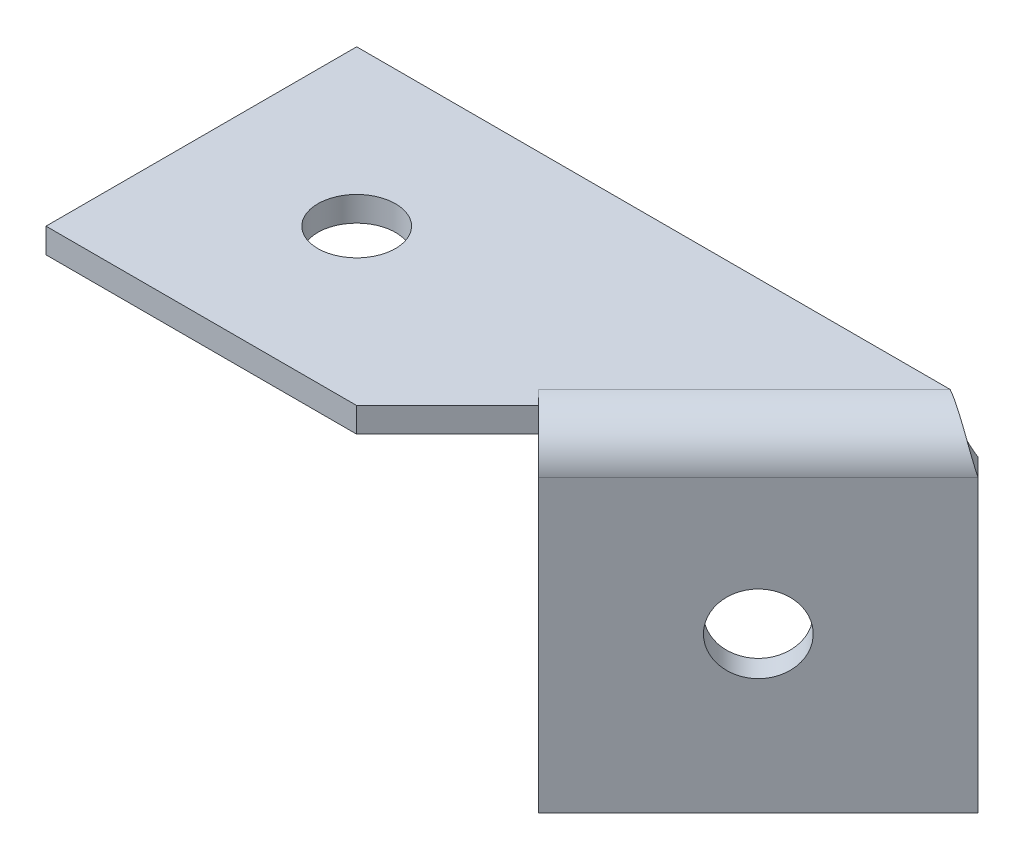
ISO-10303-21;
HEADER;
FILE_DESCRIPTION(('STEP AP214'),'2;1');
FILE_NAME('part.step','',(''),(''),'','','');
FILE_SCHEMA(('AUTOMOTIVE_DESIGN { 1 0 10303 214 1 1 1 1 }'));
ENDSEC;
DATA;
#1=APPLICATION_CONTEXT('core data for automotive mechanical design processes');
#2=APPLICATION_PROTOCOL_DEFINITION('international standard','automotive_design',2000,#1);
#3=PRODUCT_CONTEXT('',#1,'mechanical');
#4=PRODUCT('Part','Part','',(#3));
#5=PRODUCT_RELATED_PRODUCT_CATEGORY('part','',(#4));
#6=PRODUCT_DEFINITION_FORMATION('','',#4);
#7=PRODUCT_DEFINITION_CONTEXT('part definition',#1,'design');
#8=PRODUCT_DEFINITION('design','',#6,#7);
#9=PRODUCT_DEFINITION_SHAPE('','',#8);
#10=(LENGTH_UNIT() NAMED_UNIT(*) SI_UNIT(.MILLI.,.METRE.));
#11=(NAMED_UNIT(*) PLANE_ANGLE_UNIT() SI_UNIT($,.RADIAN.));
#12=(NAMED_UNIT(*) SI_UNIT($,.STERADIAN.) SOLID_ANGLE_UNIT());
#13=UNCERTAINTY_MEASURE_WITH_UNIT(LENGTH_MEASURE(1.E-05),#10,'distance_accuracy_value','');
#14=(GEOMETRIC_REPRESENTATION_CONTEXT(3) GLOBAL_UNCERTAINTY_ASSIGNED_CONTEXT((#13)) GLOBAL_UNIT_ASSIGNED_CONTEXT((#10,
#11,#12)) REPRESENTATION_CONTEXT('',''));
#15=CARTESIAN_POINT('',(0.,0.,0.));
#16=DIRECTION('',(0.,0.,1.));
#17=DIRECTION('',(1.,0.,0.));
#18=AXIS2_PLACEMENT_3D('',#15,#16,#17);
#19=CARTESIAN_POINT('',(9.95983876416214,-3.2,3.24411001162404));
#20=DIRECTION('',(0.707106781186547,0.,-0.707106781186547));
#21=DIRECTION('',(-0.707106781186548,0.,-0.707106781186548));
#22=AXIS2_PLACEMENT_3D('',#19,#20,#21);
#23=PLANE('',#22);
#24=DIRECTION('',(-0.707106781186548,0.,-0.707106781186548));
#25=VECTOR('',#24,1.);
#26=CARTESIAN_POINT('',(3.35786437626905,-1.6,-3.35786437626905));
#27=LINE('',#26,#25);
#28=CARTESIAN_POINT('',(10.8578643762691,-1.6,4.14213562373095));
#29=VERTEX_POINT('',#28);
#30=CARTESIAN_POINT('',(9.95983876416214,-1.6,3.24411001162404));
#31=VERTEX_POINT('',#30);
#32=EDGE_CURVE('E282',#29,#31,#27,.T.);
#33=ORIENTED_EDGE('',*,*,#32,.F.);
#34=DIRECTION('',(0.,1.,0.));
#35=VECTOR('',#34,1.);
#36=CARTESIAN_POINT('',(10.8578643762691,-3.2,4.14213562373095));
#37=LINE('',#36,#35);
#38=CARTESIAN_POINT('',(10.8578643762691,-1.89628672925673,4.14213562373095));
#39=VERTEX_POINT('',#38);
#40=EDGE_CURVE('E291',#39,#29,#37,.T.);
#41=ORIENTED_EDGE('',*,*,#40,.F.);
#42=CARTESIAN_POINT('',(9.95983876416214,-4.47,3.24411001162404));
#43=DIRECTION('',(-0.707106781186548,0.,0.707106781186548));
#44=DIRECTION('',(-0.707106781186548,0.,-0.707106781186548));
#45=AXIS2_PLACEMENT_3D('',#42,#43,#44);
#46=CIRCLE('',#45,2.87);
#47=EDGE_CURVE('E295',#31,#39,#46,.F.);
#48=ORIENTED_EDGE('',*,*,#47,.F.);
#49=EDGE_LOOP('',(#33,#41,#48));
#50=FACE_BOUND('',#49,.T.);
#51=ADVANCED_FACE('F43',(#50),#23,.T.);
#52=CARTESIAN_POINT('',(-15.,-1.6,-10.));
#53=DIRECTION('',(0.,0.,-1.));
#54=DIRECTION('',(-1.,0.,0.));
#55=AXIS2_PLACEMENT_3D('',#52,#53,#54);
#56=PLANE('',#55);
#57=DIRECTION('',(-1.,0.,0.));
#58=VECTOR('',#57,1.);
#59=CARTESIAN_POINT('',(-15.,-3.2,-10.));
#60=LINE('',#59,#58);
#61=CARTESIAN_POINT('',(23.2039487757862,-3.2,-10.));
#62=VERTEX_POINT('',#61);
#63=CARTESIAN_POINT('',(-15.,-3.2,-10.));
#64=VERTEX_POINT('',#63);
#65=EDGE_CURVE('E252',#62,#64,#60,.T.);
#66=ORIENTED_EDGE('',*,*,#65,.T.);
#67=DIRECTION('',(0.,-1.,0.));
#68=VECTOR('',#67,1.);
#69=CARTESIAN_POINT('',(-15.,-1.6,-10.));
#70=LINE('',#69,#68);
#71=CARTESIAN_POINT('',(-15.,-1.6,-10.));
#72=VERTEX_POINT('',#71);
#73=EDGE_CURVE('E11',#72,#64,#70,.T.);
#74=ORIENTED_EDGE('',*,*,#73,.F.);
#75=DIRECTION('',(-1.,0.,0.));
#76=VECTOR('',#75,1.);
#77=CARTESIAN_POINT('',(-15.,-1.6,-10.));
#78=LINE('',#77,#76);
#79=CARTESIAN_POINT('',(23.2039487757862,-1.6,-10.));
#80=VERTEX_POINT('',#79);
#81=EDGE_CURVE('E258',#80,#72,#78,.T.);
#82=ORIENTED_EDGE('',*,*,#81,.F.);
#83=DIRECTION('',(0.,1.,0.));
#84=VECTOR('',#83,1.);
#85=CARTESIAN_POINT('',(23.2039487757862,-3.2,-10.));
#86=LINE('',#85,#84);
#87=EDGE_CURVE('E165',#62,#80,#86,.T.);
#88=ORIENTED_EDGE('',*,*,#87,.F.);
#89=EDGE_LOOP('',(#66,#74,#82,#88));
#90=FACE_BOUND('',#89,.T.);
#91=ADVANCED_FACE('F208',(#90),#56,.T.);
#92=CARTESIAN_POINT('',(5.,-1.6,10.));
#93=DIRECTION('',(0.707106781186548,0.,0.707106781186548));
#94=DIRECTION('',(0.707106781186548,0.,-0.707106781186548));
#95=AXIS2_PLACEMENT_3D('',#92,#93,#94);
#96=PLANE('',#95);
#97=DIRECTION('',(0.707106781186548,0.,-0.707106781186547));
#98=VECTOR('',#97,1.);
#99=CARTESIAN_POINT('',(5.,-1.6,10.));
#100=LINE('',#99,#98);
#101=CARTESIAN_POINT('',(5.,-1.6,10.));
#102=VERTEX_POINT('',#101);
#103=EDGE_CURVE('E255',#102,#29,#100,.T.);
#104=ORIENTED_EDGE('',*,*,#103,.F.);
#105=DIRECTION('',(0.,-1.,0.));
#106=VECTOR('',#105,1.);
#107=CARTESIAN_POINT('',(5.,-1.6,10.));
#108=LINE('',#107,#106);
#109=CARTESIAN_POINT('',(5.,-3.2,10.));
#110=VERTEX_POINT('',#109);
#111=EDGE_CURVE('E53',#102,#110,#108,.T.);
#112=ORIENTED_EDGE('',*,*,#111,.T.);
#113=DIRECTION('',(0.707106781186548,0.,-0.707106781186547));
#114=VECTOR('',#113,1.);
#115=CARTESIAN_POINT('',(5.,-3.2,10.));
#116=LINE('',#115,#114);
#117=CARTESIAN_POINT('',(10.8578643762691,-3.2,4.14213562373095));
#118=VERTEX_POINT('',#117);
#119=EDGE_CURVE('E245',#110,#118,#116,.T.);
#120=ORIENTED_EDGE('',*,*,#119,.T.);
#121=EDGE_CURVE('E289',#118,#39,#37,.T.);
#122=ORIENTED_EDGE('',*,*,#121,.T.);
#123=ORIENTED_EDGE('',*,*,#40,.T.);
#124=EDGE_LOOP('',(#104,#112,#120,#122,#123));
#125=FACE_BOUND('',#124,.T.);
#126=ADVANCED_FACE('F219',(#125),#96,.T.);
#127=CARTESIAN_POINT('',(0.,-1.6,0.));
#128=DIRECTION('',(0.,-1.,0.));
#129=DIRECTION('',(0.,0.,1.));
#130=AXIS2_PLACEMENT_3D('',#127,#128,#129);
#131=PLANE('',#130);
#132=CARTESIAN_POINT('',(-5.,-1.6,0.));
#133=DIRECTION('',(0.,1.,0.));
#134=DIRECTION('',(0.,0.,1.));
#135=AXIS2_PLACEMENT_3D('',#132,#133,#134);
#136=CIRCLE('',#135,2.5);
#137=CARTESIAN_POINT('',(-5.,-1.6,2.5));
#138=VERTEX_POINT('',#137);
#139=EDGE_CURVE('E266',#138,#138,#136,.T.);
#140=ORIENTED_EDGE('',*,*,#139,.F.);
#141=EDGE_LOOP('',(#140));
#142=FACE_BOUND('',#141,.T.);
#143=DIRECTION('',(0.707106781186548,0.,-0.707106781186548));
#144=VECTOR('',#143,1.);
#145=CARTESIAN_POINT('',(24.1019743878931,-1.6,-10.8980256121069));
#146=LINE('',#145,#144);
#147=EDGE_CURVE('E168',#80,#31,#146,.F.);
#148=ORIENTED_EDGE('',*,*,#147,.F.);
#149=ORIENTED_EDGE('',*,*,#81,.T.);
#150=DIRECTION('',(0.,0.,1.));
#151=VECTOR('',#150,1.);
#152=CARTESIAN_POINT('',(-15.,-1.6,-10.));
#153=LINE('',#152,#151);
#154=CARTESIAN_POINT('',(-15.,-1.6,10.));
#155=VERTEX_POINT('',#154);
#156=EDGE_CURVE('E262',#72,#155,#153,.T.);
#157=ORIENTED_EDGE('',*,*,#156,.T.);
#158=DIRECTION('',(1.,0.,0.));
#159=VECTOR('',#158,1.);
#160=CARTESIAN_POINT('',(-15.,-1.6,10.));
#161=LINE('',#160,#159);
#162=EDGE_CURVE('E272',#155,#102,#161,.T.);
#163=ORIENTED_EDGE('',*,*,#162,.T.);
#164=ORIENTED_EDGE('',*,*,#103,.T.);
#165=ORIENTED_EDGE('',*,*,#32,.T.);
#166=EDGE_LOOP('',(#148,#149,#157,#163,#164,#165));
#167=FACE_BOUND('',#166,.T.);
#168=ADVANCED_FACE('F215',(#142,#167),#131,.F.);
#169=CARTESIAN_POINT('',(0.,-3.2,0.));
#170=DIRECTION('',(0.,-1.,0.));
#171=DIRECTION('',(0.,0.,1.));
#172=AXIS2_PLACEMENT_3D('',#169,#170,#171);
#173=PLANE('',#172);
#174=CARTESIAN_POINT('',(-5.,-3.2,0.));
#175=DIRECTION('',(0.,1.,0.));
#176=DIRECTION('',(0.,0.,1.));
#177=AXIS2_PLACEMENT_3D('',#174,#175,#176);
#178=CIRCLE('',#177,2.5);
#179=CARTESIAN_POINT('',(-5.,-3.2,2.5));
#180=VERTEX_POINT('',#179);
#181=EDGE_CURVE('E278',#180,#180,#178,.T.);
#182=ORIENTED_EDGE('',*,*,#181,.T.);
#183=EDGE_LOOP('',(#182));
#184=FACE_BOUND('',#183,.T.);
#185=DIRECTION('',(0.707106781186547,0.,0.707106781186547));
#186=VECTOR('',#185,1.);
#187=CARTESIAN_POINT('',(9.95983876416214,-3.2,3.24411001162404));
#188=LINE('',#187,#186);
#189=CARTESIAN_POINT('',(9.95983876416214,-3.2,3.24411001162404));
#190=VERTEX_POINT('',#189);
#191=EDGE_CURVE('E250',#190,#118,#188,.T.);
#192=ORIENTED_EDGE('',*,*,#191,.T.);
#193=ORIENTED_EDGE('',*,*,#119,.F.);
#194=DIRECTION('',(1.,0.,0.));
#195=VECTOR('',#194,1.);
#196=CARTESIAN_POINT('',(-15.,-3.2,10.));
#197=LINE('',#196,#195);
#198=CARTESIAN_POINT('',(-15.,-3.2,10.));
#199=VERTEX_POINT('',#198);
#200=EDGE_CURVE('E237',#199,#110,#197,.T.);
#201=ORIENTED_EDGE('',*,*,#200,.F.);
#202=DIRECTION('',(0.,0.,1.));
#203=VECTOR('',#202,1.);
#204=CARTESIAN_POINT('',(-15.,-3.2,-10.));
#205=LINE('',#204,#203);
#206=EDGE_CURVE('E246',#64,#199,#205,.T.);
#207=ORIENTED_EDGE('',*,*,#206,.F.);
#208=ORIENTED_EDGE('',*,*,#65,.F.);
#209=DIRECTION('',(0.707106781186548,0.,-0.707106781186548));
#210=VECTOR('',#209,1.);
#211=CARTESIAN_POINT('',(24.1019743878931,-3.2,-10.8980256121069));
#212=LINE('',#211,#210);
#213=EDGE_CURVE('E173',#62,#190,#212,.F.);
#214=ORIENTED_EDGE('',*,*,#213,.T.);
#215=EDGE_LOOP('',(#192,#193,#201,#207,#208,#214));
#216=FACE_BOUND('',#215,.T.);
#217=ADVANCED_FACE('F218',(#184,#216),#173,.T.);
#218=CARTESIAN_POINT('',(-15.,-1.6,-10.));
#219=DIRECTION('',(-1.,0.,0.));
#220=DIRECTION('',(0.,0.,1.));
#221=AXIS2_PLACEMENT_3D('',#218,#219,#220);
#222=PLANE('',#221);
#223=ORIENTED_EDGE('',*,*,#206,.T.);
#224=DIRECTION('',(0.,-1.,0.));
#225=VECTOR('',#224,1.);
#226=CARTESIAN_POINT('',(-15.,-1.6,10.));
#227=LINE('',#226,#225);
#228=EDGE_CURVE('E47',#155,#199,#227,.T.);
#229=ORIENTED_EDGE('',*,*,#228,.F.);
#230=ORIENTED_EDGE('',*,*,#156,.F.);
#231=ORIENTED_EDGE('',*,*,#73,.T.);
#232=EDGE_LOOP('',(#223,#229,#230,#231));
#233=FACE_BOUND('',#232,.T.);
#234=ADVANCED_FACE('F45',(#233),#222,.T.);
#235=CARTESIAN_POINT('',(-15.,-1.6,10.));
#236=DIRECTION('',(0.,0.,1.));
#237=DIRECTION('',(1.,0.,0.));
#238=AXIS2_PLACEMENT_3D('',#235,#236,#237);
#239=PLANE('',#238);
#240=ORIENTED_EDGE('',*,*,#200,.T.);
#241=ORIENTED_EDGE('',*,*,#111,.F.);
#242=ORIENTED_EDGE('',*,*,#162,.F.);
#243=ORIENTED_EDGE('',*,*,#228,.T.);
#244=EDGE_LOOP('',(#240,#241,#242,#243));
#245=FACE_BOUND('',#244,.T.);
#246=ADVANCED_FACE('F213',(#245),#239,.T.);
#247=CARTESIAN_POINT('',(-5.,-1.6,0.));
#248=DIRECTION('',(0.,-1.,0.));
#249=DIRECTION('',(0.,0.,1.));
#250=AXIS2_PLACEMENT_3D('',#247,#248,#249);
#251=CYLINDRICAL_SURFACE('',#250,2.5);
#252=ORIENTED_EDGE('',*,*,#139,.T.);
#253=EDGE_LOOP('',(#252));
#254=FACE_BOUND('',#253,.T.);
#255=ORIENTED_EDGE('',*,*,#181,.F.);
#256=EDGE_LOOP('',(#255));
#257=FACE_BOUND('',#256,.T.);
#258=ADVANCED_FACE('F210',(#254,#257),#251,.F.);
#259=CARTESIAN_POINT('',(9.95983876416214,-4.47,3.24411001162404));
#260=DIRECTION('',(-0.707106781186548,0.,0.707106781186548));
#261=DIRECTION('',(0.707106781186548,0.,0.707106781186548));
#262=AXIS2_PLACEMENT_3D('',#259,#260,#261);
#263=PLANE('',#262);
#264=ORIENTED_EDGE('',*,*,#191,.F.);
#265=CARTESIAN_POINT('',(9.95983876416214,-4.47,3.24411001162404));
#266=DIRECTION('',(-0.707106781186548,0.,0.707106781186548));
#267=DIRECTION('',(-0.707106781186548,0.,-0.707106781186548));
#268=AXIS2_PLACEMENT_3D('',#265,#266,#267);
#269=CIRCLE('',#268,1.27);
#270=CARTESIAN_POINT('',(10.8578643762691,-4.46999999999999,4.14213562373095));
#271=VERTEX_POINT('',#270);
#272=EDGE_CURVE('E69',#190,#271,#269,.F.);
#273=ORIENTED_EDGE('',*,*,#272,.T.);
#274=DIRECTION('',(0.707106781186548,0.,0.707106781186548));
#275=VECTOR('',#274,1.);
#276=CARTESIAN_POINT('',(10.8578643762691,-4.46999999999999,4.14213562373095));
#277=LINE('',#276,#275);
#278=CARTESIAN_POINT('',(11.9892352261675,-4.46999999999999,5.27350647362943));
#279=VERTEX_POINT('',#278);
#280=EDGE_CURVE('E327',#271,#279,#277,.T.);
#281=ORIENTED_EDGE('',*,*,#280,.T.);
#282=EDGE_CURVE('E61',#39,#279,#46,.F.);
#283=ORIENTED_EDGE('',*,*,#282,.F.);
#284=ORIENTED_EDGE('',*,*,#121,.F.);
#285=EDGE_LOOP('',(#264,#273,#281,#283,#284));
#286=FACE_BOUND('',#285,.T.);
#287=ADVANCED_FACE('F199',(#286),#263,.T.);
#288=CARTESIAN_POINT('',(26.1426845583975,-4.46999999999999,-8.85731544160254));
#289=CARTESIAN_POINT('',(26.0678365611497,-4.09216031489176,-8.78246744435475));
#290=CARTESIAN_POINT('',(25.9398993996123,-3.71459560573911,-8.76075872968536));
#291=CARTESIAN_POINT('',(25.5857772867536,-3.01655562264958,-8.8155389718418));
#292=CARTESIAN_POINT('',(25.3596853078123,-2.69641816615239,-8.89196001543195));
#293=CARTESIAN_POINT('',(24.832237855867,-2.16216149283885,-9.12006559667497));
#294=CARTESIAN_POINT('',(24.5310310217904,-1.94825248320961,-9.27160149540037));
#295=CARTESIAN_POINT('',(23.8877712808573,-1.65911485513524,-9.61551936563117));
#296=CARTESIAN_POINT('',(23.5459697765754,-1.584,-9.80767499370637));
#297=CARTESIAN_POINT('',(23.2039487757862,-1.584,-10.));
#298=CARTESIAN_POINT('',(26.1313708498985,-4.46999999999999,-8.86862915010153));
#299=CARTESIAN_POINT('',(26.056522881643,-4.09425512424837,-8.79378118184603));
#300=CARTESIAN_POINT('',(25.9288801566625,-3.71878357188886,-8.77177797263517));
#301=CARTESIAN_POINT('',(25.5758915222654,-3.02461352633551,-8.82542473633002));
#302=CARTESIAN_POINT('',(25.3506381102611,-2.70625091367199,-8.90100721298315));
#303=CARTESIAN_POINT('',(24.8252850534182,-2.17495616231722,-9.12701839912378));
#304=CARTESIAN_POINT('',(24.5253332234519,-1.96223306542328,-9.27729929373885));
#305=CARTESIAN_POINT('',(23.8848099415934,-1.67469841796194,-9.61848070489504));
#306=CARTESIAN_POINT('',(23.5444884936817,-1.6,-9.80915621861543));
#307=CARTESIAN_POINT('',(23.2039487757862,-1.6,-10.));
#308=CARTESIAN_POINT('',(25.,-4.47,-10.));
#309=CARTESIAN_POINT('',(24.9251549309741,-4.30373605990976,-9.9251549309741));
#310=CARTESIAN_POINT('',(24.8269558616824,-4.13758018686371,-9.87370226761529));
#311=CARTESIAN_POINT('',(24.5873150734433,-3.83040389492896,-9.81400118515209));
#312=CARTESIAN_POINT('',(24.4459183551414,-3.68952566563186,-9.80572696810281));
#313=CARTESIAN_POINT('',(24.1300048085378,-3.45442311015431,-9.82229864400411));
#314=CARTESIAN_POINT('',(23.9555533896047,-3.36029128679009,-9.84707912758607));
#315=CARTESIAN_POINT('',(23.5886760152068,-3.23305470063124,-9.91461463128172));
#316=CARTESIAN_POINT('',(23.3963602043167,-3.2,-9.95727870952131));
#317=CARTESIAN_POINT('',(23.2039487757862,-3.2,-10.));
#318=CARTESIAN_POINT('',(24.988573154416,-4.47,-10.011426845584));
#319=CARTESIAN_POINT('',(24.9137281146724,-4.30585181735994,-9.93658180584029));
#320=CARTESIAN_POINT('',(24.8158264263031,-4.14181003267496,-9.88483170299459));
#321=CARTESIAN_POINT('',(24.5773304513102,-3.83854237765175,-9.82398580728519));
#322=CARTESIAN_POINT('',(24.4367806856147,-3.69945674062665,-9.81486463762952));
#323=CARTESIAN_POINT('',(24.1229824780645,-3.46734572632747,-9.82932097447741));
#324=CARTESIAN_POINT('',(23.9497986132829,-3.3744116748259,-9.85283390390793));
#325=CARTESIAN_POINT('',(23.5856850625503,-3.2487940990862,-9.91760558393823));
#326=CARTESIAN_POINT('',(23.3948641085941,-3.21616,-9.95877474667946));
#327=CARTESIAN_POINT('',(23.2039487757862,-3.21616,-10.));
#328=B_SPLINE_SURFACE_WITH_KNOTS('',1,3,((#288,#289,#290,#291,#292,#293,#294,#295,#296,#297),
(#298,#299,#300,#301,#302,#303,#304,#305,#306,#307),(#308,#309,#310,#311,#312,#313,#314,#315,
#316,#317),(#318,#319,#320,#321,#322,#323,#324,#325,#326,#327)),.UNSPECIFIED.,.F.,.F.,.F.,(2,1,
1,2),(4,2,2,2,4),(-0.01,0.,1.,1.0101),(0.,0.25,0.5,0.75,1.),.UNSPECIFIED.);
#329=CARTESIAN_POINT('',(25.,-4.47,-10.));
#330=CARTESIAN_POINT('',(24.9794457157982,-4.42432779684599,-9.97943207975731));
#331=CARTESIAN_POINT('',(24.9571376153336,-4.37865770544456,-9.96062154135036));
#332=CARTESIAN_POINT('',(24.9090622230194,-4.28784772906659,-9.92646226345873));
#333=CARTESIAN_POINT('',(24.8832950035817,-4.24270783301265,-9.91111345152556));
#334=CARTESIAN_POINT('',(24.8283898465385,-4.15354868526726,-9.88384411707349));
#335=CARTESIAN_POINT('',(24.7992569837026,-4.10952786540567,-9.871918525195));
#336=CARTESIAN_POINT('',(24.7377089011005,-4.02306407330992,-9.85136290278667));
#337=CARTESIAN_POINT('',(24.7052940060129,-3.98062094556768,-9.8427325466743));
#338=CARTESIAN_POINT('',(24.6080696158124,-3.86219004236852,-9.8225815464238));
#339=CARTESIAN_POINT('',(24.5393345115583,-3.78867668036854,-9.81493761384507));
#340=CARTESIAN_POINT('',(24.3922044657137,-3.65179663740178,-9.8093867467967));
#341=CARTESIAN_POINT('',(24.3138151306375,-3.58842411604266,-9.81147418673117));
#342=CARTESIAN_POINT('',(24.148927662593,-3.47425379356605,-9.82375878455755));
#343=CARTESIAN_POINT('',(24.0624300117423,-3.42345524545779,-9.83395546054673));
#344=CARTESIAN_POINT('',(23.883226845443,-3.33646066661548,-9.86052775410516));
#345=CARTESIAN_POINT('',(23.7905196089405,-3.30026870394441,-9.87690509058873));
#346=CARTESIAN_POINT('',(23.6157116167698,-3.24828949808716,-9.91082866843306));
#347=CARTESIAN_POINT('',(23.5341760736405,-3.23021827434568,-9.92780650538194));
#348=CARTESIAN_POINT('',(23.4108664319563,-3.21210925365228,-9.9543412556854));
#349=CARTESIAN_POINT('',(23.3695978743683,-3.20757255145035,-9.96336362769672));
#350=CARTESIAN_POINT('',(23.2868734095944,-3.20151705875711,-9.98158995089415));
#351=CARTESIAN_POINT('',(23.245417475617,-3.19999871445652,-9.99079392872318));
#352=CARTESIAN_POINT('',(23.2039487757862,-3.2,-10.));
#353=B_SPLINE_CURVE_WITH_KNOTS('',3,(#329,#330,#331,#332,#333,#334,#335,#336,#337,#338,#339,
#340,#341,#342,#343,#344,#345,#346,#347,#348,#349,#350,#351,#352),.UNSPECIFIED.,.F.,.F.,(4,2,2,
2,2,2,2,2,2,2,2,4),(0.,0.162367301932304,0.324731205457654,0.486853413122981,0.64895959831588,
0.950196690891847,1.25125966332813,1.55230474601191,1.85343361464476,2.10818921190071,
2.23555251334031,2.36293464094355),.UNSPECIFIED.);
#354=CARTESIAN_POINT('',(25.,-4.47,-10.));
#355=VERTEX_POINT('',#354);
#356=EDGE_CURVE('E184',#355,#62,#353,.T.);
#357=CARTESIAN_POINT('',(26.1313708498985,-4.46999999999999,-8.86862915010153));
#358=CARTESIAN_POINT('',(26.1146679011241,-4.38612098918057,-8.85191336233403));
#359=CARTESIAN_POINT('',(26.0953529044557,-4.30224582399755,-8.83781145690155));
#360=CARTESIAN_POINT('',(26.0515479860515,-4.13514308167233,-8.8147857471382));
#361=CARTESIAN_POINT('',(26.0270583331944,-4.05191547111564,-8.8058616738539));
#362=CARTESIAN_POINT('',(25.9729726739047,-3.88680344272603,-8.79314521039306));
#363=CARTESIAN_POINT('',(25.9433806737856,-3.80491802584385,-8.78934881451916));
#364=CARTESIAN_POINT('',(25.8791933727098,-3.64307811700952,-8.78676601515012));
#365=CARTESIAN_POINT('',(25.8445981369767,-3.56312359990146,-8.78797954634983));
#366=CARTESIAN_POINT('',(25.7334382981449,-3.32697353414172,-8.79895958129342));
#367=CARTESIAN_POINT('',(25.6494855290853,-3.17444832749489,-8.81606236566385));
#368=CARTESIAN_POINT('',(25.4636099281886,-2.88431679088053,-8.86829719414534));
#369=CARTESIAN_POINT('',(25.3616912039831,-2.74670706231368,-8.90342512059317));
#370=CARTESIAN_POINT('',(25.1419276381073,-2.49047941600512,-8.98959159445194));
#371=CARTESIAN_POINT('',(25.0240836083806,-2.37186053069801,-9.04062933088246));
#372=CARTESIAN_POINT('',(24.7750234407033,-2.15723186112174,-9.15606496790492));
#373=CARTESIAN_POINT('',(24.6438028842566,-2.06122958240265,-9.2204672903716));
#374=CARTESIAN_POINT('',(24.3709890645342,-1.89479464517456,-9.35962055205355));
#375=CARTESIAN_POINT('',(24.2293920992865,-1.82437116626518,-9.43437519319274));
#376=CARTESIAN_POINT('',(23.9392418142602,-1.71135502160739,-9.59088143779829));
#377=CARTESIAN_POINT('',(23.7906959531454,-1.66873321732694,-9.67262561363423));
#378=CARTESIAN_POINT('',(23.5682412431027,-1.62710129582809,-9.79620130167937));
#379=CARTESIAN_POINT('',(23.4955551192526,-1.61693696282224,-9.8367588045818));
#380=CARTESIAN_POINT('',(23.3499068580748,-1.60339273603113,-9.91820516017964));
#381=CARTESIAN_POINT('',(23.2769454326988,-1.60000092023579,-9.95909330316333));
#382=CARTESIAN_POINT('',(23.2039487757862,-1.6,-10.));
#383=B_SPLINE_CURVE_WITH_KNOTS('',3,(#357,#358,#359,#360,#361,#362,#363,#364,#365,#366,#367,
#368,#369,#370,#371,#372,#373,#374,#375,#376,#377,#378,#379,#380,#381,#382),.UNSPECIFIED.,.F.,
.F.,(4,2,2,2,2,2,2,2,2,2,2,2,4),(0.,0.261347103696602,0.52268063095964,0.783809888420262,
1.04493574203159,1.56705273281083,2.08905050425551,2.6110216719407,3.13316581780048,
3.65549716358532,4.17728017806127,4.42860669953635,4.67949040659082),.UNSPECIFIED.);
#384=CARTESIAN_POINT('',(26.1313708498985,-4.46999999999999,-8.86862915010152));
#385=VERTEX_POINT('',#384);
#386=EDGE_CURVE('E146',#385,#80,#383,.T.);
#387=DIRECTION('',(0.707106781186548,0.,0.707106781186548));
#388=VECTOR('',#387,1.);
#389=CARTESIAN_POINT('',(25.,-4.47,-10.));
#390=LINE('',#389,#388);
#391=EDGE_CURVE('E151',#355,#385,#390,.T.);
#392=ORIENTED_EDGE('',*,*,#356,.T.);
#393=ORIENTED_EDGE('',*,*,#87,.T.);
#394=ORIENTED_EDGE('',*,*,#386,.F.);
#395=ORIENTED_EDGE('',*,*,#391,.F.);
#396=EDGE_LOOP('',(#392,#393,#394,#395));
#397=FACE_BOUND('',#396,.T.);
#398=ADVANCED_FACE('F163',(#397),#328,.T.);
#399=CARTESIAN_POINT('',(24.1019743878931,-4.47,-10.8980256121069));
#400=DIRECTION('',(0.707106781186548,0.,-0.707106781186548));
#401=DIRECTION('',(0.707106781186548,0.,0.707106781186548));
#402=AXIS2_PLACEMENT_3D('',#399,#400,#401);
#403=CYLINDRICAL_SURFACE('',#402,2.87);
#404=ORIENTED_EDGE('',*,*,#147,.T.);
#405=ORIENTED_EDGE('',*,*,#47,.T.);
#406=ORIENTED_EDGE('',*,*,#282,.T.);
#407=DIRECTION('',(-0.707106781186548,0.,0.707106781186547));
#408=VECTOR('',#407,1.);
#409=CARTESIAN_POINT('',(8.63137084989848,-4.46999999999999,8.63137084989848));
#410=LINE('',#409,#408);
#411=EDGE_CURVE('E134',#385,#279,#410,.T.);
#412=ORIENTED_EDGE('',*,*,#411,.F.);
#413=ORIENTED_EDGE('',*,*,#386,.T.);
#414=EDGE_LOOP('',(#404,#405,#406,#412,#413));
#415=FACE_BOUND('',#414,.T.);
#416=ADVANCED_FACE('F144',(#415),#403,.T.);
#417=CARTESIAN_POINT('',(24.1019743878931,-4.47,-10.8980256121069));
#418=DIRECTION('',(0.707106781186548,0.,-0.707106781186548));
#419=DIRECTION('',(0.707106781186548,0.,0.707106781186548));
#420=AXIS2_PLACEMENT_3D('',#417,#418,#419);
#421=CYLINDRICAL_SURFACE('',#420,1.27);
#422=ORIENTED_EDGE('',*,*,#213,.F.);
#423=ORIENTED_EDGE('',*,*,#356,.F.);
#424=DIRECTION('',(0.707106781186548,0.,-0.707106781186548));
#425=VECTOR('',#424,1.);
#426=CARTESIAN_POINT('',(10.8578643762691,-4.46999999999999,4.14213562373095));
#427=LINE('',#426,#425);
#428=EDGE_CURVE('E160',#271,#355,#427,.T.);
#429=ORIENTED_EDGE('',*,*,#428,.F.);
#430=ORIENTED_EDGE('',*,*,#272,.F.);
#431=EDGE_LOOP('',(#422,#423,#429,#430));
#432=FACE_BOUND('',#431,.T.);
#433=ADVANCED_FACE('F364',(#432),#421,.F.);
#434=CARTESIAN_POINT('',(26.1313708498985,-23.2,-8.86862915010148));
#435=DIRECTION('',(-0.707106781186548,0.,0.707106781186548));
#436=DIRECTION('',(0.707106781186548,0.,0.707106781186548));
#437=AXIS2_PLACEMENT_3D('',#434,#435,#436);
#438=PLANE('',#437);
#439=ORIENTED_EDGE('',*,*,#391,.T.);
#440=DIRECTION('',(0.,-1.,0.));
#441=VECTOR('',#440,1.);
#442=CARTESIAN_POINT('',(26.1313708498985,-23.2,-8.86862915010148));
#443=LINE('',#442,#441);
#444=CARTESIAN_POINT('',(26.1313708498985,-23.2,-8.86862915010148));
#445=VERTEX_POINT('',#444);
#446=EDGE_CURVE('E130',#385,#445,#443,.T.);
#447=ORIENTED_EDGE('',*,*,#446,.T.);
#448=DIRECTION('',(-0.707106781186548,0.,-0.707106781186548));
#449=VECTOR('',#448,1.);
#450=CARTESIAN_POINT('',(26.1313708498985,-23.2,-8.86862915010148));
#451=LINE('',#450,#449);
#452=CARTESIAN_POINT('',(25.0000000000001,-23.2,-9.99999999999995));
#453=VERTEX_POINT('',#452);
#454=EDGE_CURVE('E302',#445,#453,#451,.T.);
#455=ORIENTED_EDGE('',*,*,#454,.T.);
#456=DIRECTION('',(0.,-1.,0.));
#457=VECTOR('',#456,1.);
#458=CARTESIAN_POINT('',(25.0000000000001,-23.2,-9.99999999999995));
#459=LINE('',#458,#457);
#460=EDGE_CURVE('E150',#355,#453,#459,.T.);
#461=ORIENTED_EDGE('',*,*,#460,.F.);
#462=EDGE_LOOP('',(#439,#447,#455,#461));
#463=FACE_BOUND('',#462,.T.);
#464=ADVANCED_FACE('F154',(#463),#438,.F.);
#465=CARTESIAN_POINT('',(11.9892352261675,-3.19999999999999,5.27350647362942));
#466=DIRECTION('',(0.707106781186548,0.,-0.707106781186548));
#467=DIRECTION('',(-0.707106781186548,0.,-0.707106781186548));
#468=AXIS2_PLACEMENT_3D('',#465,#466,#467);
#469=PLANE('',#468);
#470=ORIENTED_EDGE('',*,*,#280,.F.);
#471=DIRECTION('',(0.,1.,0.));
#472=VECTOR('',#471,1.);
#473=CARTESIAN_POINT('',(10.8578643762691,-3.2,4.14213562373095));
#474=LINE('',#473,#472);
#475=CARTESIAN_POINT('',(10.8578643762691,-23.2,4.142135623731));
#476=VERTEX_POINT('',#475);
#477=EDGE_CURVE('E141',#476,#271,#474,.T.);
#478=ORIENTED_EDGE('',*,*,#477,.F.);
#479=DIRECTION('',(-0.707106781186548,0.,-0.707106781186548));
#480=VECTOR('',#479,1.);
#481=CARTESIAN_POINT('',(11.9892352261676,-23.2,5.27350647362947));
#482=LINE('',#481,#480);
#483=CARTESIAN_POINT('',(11.9892352261676,-23.2,5.27350647362947));
#484=VERTEX_POINT('',#483);
#485=EDGE_CURVE('E308',#484,#476,#482,.T.);
#486=ORIENTED_EDGE('',*,*,#485,.F.);
#487=DIRECTION('',(0.,1.,0.));
#488=VECTOR('',#487,1.);
#489=CARTESIAN_POINT('',(11.9892352261675,-3.19999999999999,5.27350647362942));
#490=LINE('',#489,#488);
#491=EDGE_CURVE('E311',#484,#279,#490,.T.);
#492=ORIENTED_EDGE('',*,*,#491,.T.);
#493=EDGE_LOOP('',(#470,#478,#486,#492));
#494=FACE_BOUND('',#493,.T.);
#495=ADVANCED_FACE('F352',(#494),#469,.F.);
#496=CARTESIAN_POINT('',(8.63137084989848,-3.19999999999996,8.63137084989848));
#497=DIRECTION('',(-0.707106781186547,0.,-0.707106781186548));
#498=DIRECTION('',(-0.707106781186548,0.,0.707106781186547));
#499=AXIS2_PLACEMENT_3D('',#496,#497,#498);
#500=PLANE('',#499);
#501=CARTESIAN_POINT('',(19.0603030380331,-13.2,-1.79756133823604));
#502=DIRECTION('',(0.707106781186547,0.,0.707106781186548));
#503=DIRECTION('',(-0.707106781186548,0.,0.707106781186547));
#504=AXIS2_PLACEMENT_3D('',#501,#502,#503);
#505=CIRCLE('',#504,2.5);
#506=CARTESIAN_POINT('',(17.2925360850667,-13.2,-0.029794385269675));
#507=VERTEX_POINT('',#506);
#508=EDGE_CURVE('E329',#507,#507,#505,.T.);
#509=ORIENTED_EDGE('',*,*,#508,.F.);
#510=EDGE_LOOP('',(#509));
#511=FACE_BOUND('',#510,.T.);
#512=ORIENTED_EDGE('',*,*,#411,.T.);
#513=ORIENTED_EDGE('',*,*,#491,.F.);
#514=DIRECTION('',(-0.707106781186548,0.,0.707106781186548));
#515=VECTOR('',#514,1.);
#516=CARTESIAN_POINT('',(11.9892352261676,-23.2,5.27350647362947));
#517=LINE('',#516,#515);
#518=EDGE_CURVE('E135',#445,#484,#517,.T.);
#519=ORIENTED_EDGE('',*,*,#518,.F.);
#520=ORIENTED_EDGE('',*,*,#446,.F.);
#521=EDGE_LOOP('',(#512,#513,#519,#520));
#522=FACE_BOUND('',#521,.T.);
#523=ADVANCED_FACE('F132',(#511,#522),#500,.F.);
#524=CARTESIAN_POINT('',(7.5,-3.19999999999996,7.50000000000001));
#525=DIRECTION('',(-0.707106781186547,0.,-0.707106781186548));
#526=DIRECTION('',(-0.707106781186548,0.,0.707106781186547));
#527=AXIS2_PLACEMENT_3D('',#524,#525,#526);
#528=PLANE('',#527);
#529=CARTESIAN_POINT('',(17.9289321881346,-13.2,-2.92893218813452));
#530=DIRECTION('',(0.707106781186547,0.,0.707106781186548));
#531=DIRECTION('',(-0.707106781186548,0.,0.707106781186547));
#532=AXIS2_PLACEMENT_3D('',#529,#530,#531);
#533=CIRCLE('',#532,2.5);
#534=CARTESIAN_POINT('',(16.1611652351682,-13.2,-1.16116523516815));
#535=VERTEX_POINT('',#534);
#536=EDGE_CURVE('E336',#535,#535,#533,.T.);
#537=ORIENTED_EDGE('',*,*,#536,.T.);
#538=EDGE_LOOP('',(#537));
#539=FACE_BOUND('',#538,.T.);
#540=ORIENTED_EDGE('',*,*,#460,.T.);
#541=DIRECTION('',(-0.707106781186548,0.,0.707106781186548));
#542=VECTOR('',#541,1.);
#543=CARTESIAN_POINT('',(10.8578643762691,-23.2,4.142135623731));
#544=LINE('',#543,#542);
#545=EDGE_CURVE('E320',#453,#476,#544,.T.);
#546=ORIENTED_EDGE('',*,*,#545,.T.);
#547=ORIENTED_EDGE('',*,*,#477,.T.);
#548=ORIENTED_EDGE('',*,*,#428,.T.);
#549=EDGE_LOOP('',(#540,#546,#547,#548));
#550=FACE_BOUND('',#549,.T.);
#551=ADVANCED_FACE('F341',(#539,#550),#528,.T.);
#552=CARTESIAN_POINT('',(11.9892352261676,-23.2,5.27350647362947));
#553=DIRECTION('',(0.,1.,0.));
#554=DIRECTION('',(0.,0.,-1.));
#555=AXIS2_PLACEMENT_3D('',#552,#553,#554);
#556=PLANE('',#555);
#557=ORIENTED_EDGE('',*,*,#545,.F.);
#558=ORIENTED_EDGE('',*,*,#454,.F.);
#559=ORIENTED_EDGE('',*,*,#518,.T.);
#560=ORIENTED_EDGE('',*,*,#485,.T.);
#561=EDGE_LOOP('',(#557,#558,#559,#560));
#562=FACE_BOUND('',#561,.T.);
#563=ADVANCED_FACE('F347',(#562),#556,.F.);
#564=CARTESIAN_POINT('',(28.5819521858726,-13.1999999999999,7.72408780960353));
#565=DIRECTION('',(-0.707106781186548,0.,-0.707106781186548));
#566=DIRECTION('',(-0.707106781186548,0.,0.707106781186547));
#567=AXIS2_PLACEMENT_3D('',#564,#565,#566);
#568=CYLINDRICAL_SURFACE('',#567,2.5);
#569=ORIENTED_EDGE('',*,*,#536,.F.);
#570=EDGE_LOOP('',(#569));
#571=FACE_BOUND('',#570,.T.);
#572=ORIENTED_EDGE('',*,*,#508,.T.);
#573=EDGE_LOOP('',(#572));
#574=FACE_BOUND('',#573,.T.);
#575=ADVANCED_FACE('F344',(#571,#574),#568,.F.);
#576=CLOSED_SHELL('',(#51,#91,#126,#168,#217,#234,#246,#258,#287,#398,#416,#433,#464,#495,#523,
#551,#563,#575));
#577=MANIFOLD_SOLID_BREP('B2',#576);
#578=ADVANCED_BREP_SHAPE_REPRESENTATION('',(#18,#577),#14);
#579=SHAPE_DEFINITION_REPRESENTATION(#9,#578);
ENDSEC;
END-ISO-10303-21;
